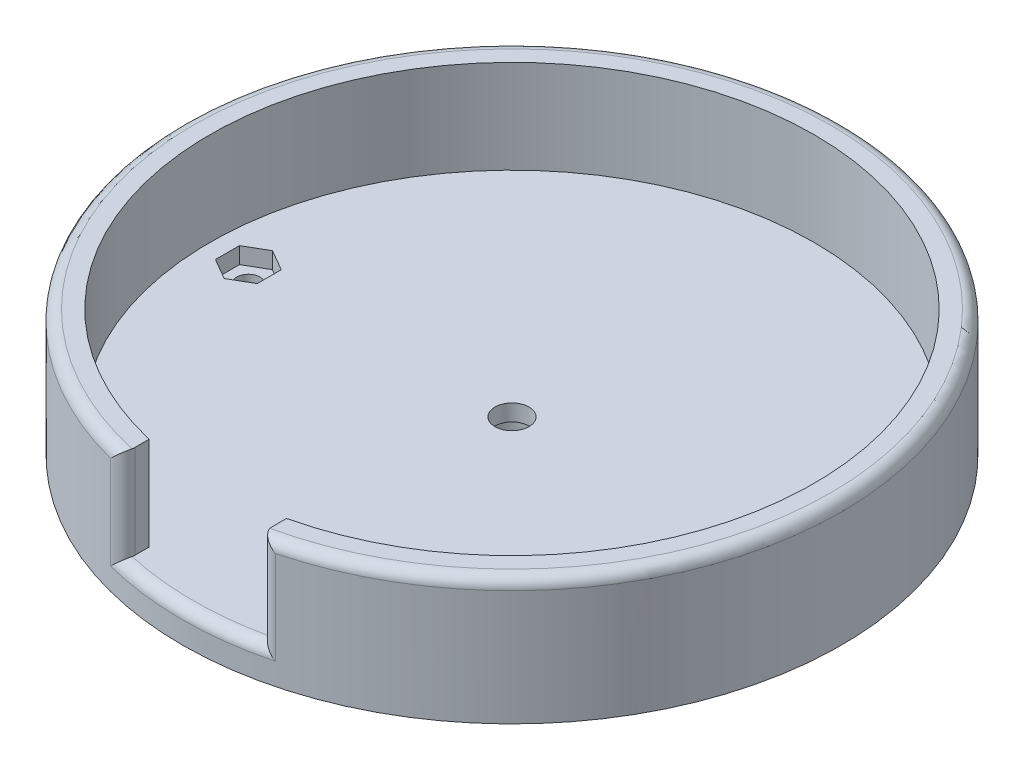
ISO-10303-21;
HEADER;
FILE_DESCRIPTION(('STEP AP214'),'2;1');
FILE_NAME('part.step','',(''),(''),'','','');
FILE_SCHEMA(('AUTOMOTIVE_DESIGN { 1 0 10303 214 1 1 1 1 }'));
ENDSEC;
DATA;
#1=APPLICATION_CONTEXT('core data for automotive mechanical design processes');
#2=APPLICATION_PROTOCOL_DEFINITION('international standard','automotive_design',2000,#1);
#3=PRODUCT_CONTEXT('',#1,'mechanical');
#4=PRODUCT('Part','Part','',(#3));
#5=PRODUCT_RELATED_PRODUCT_CATEGORY('part','',(#4));
#6=PRODUCT_DEFINITION_FORMATION('','',#4);
#7=PRODUCT_DEFINITION_CONTEXT('part definition',#1,'design');
#8=PRODUCT_DEFINITION('design','',#6,#7);
#9=PRODUCT_DEFINITION_SHAPE('','',#8);
#10=(LENGTH_UNIT() NAMED_UNIT(*) SI_UNIT(.MILLI.,.METRE.));
#11=(NAMED_UNIT(*) PLANE_ANGLE_UNIT() SI_UNIT($,.RADIAN.));
#12=(NAMED_UNIT(*) SI_UNIT($,.STERADIAN.) SOLID_ANGLE_UNIT());
#13=UNCERTAINTY_MEASURE_WITH_UNIT(LENGTH_MEASURE(1.E-05),#10,'distance_accuracy_value','');
#14=(GEOMETRIC_REPRESENTATION_CONTEXT(3) GLOBAL_UNCERTAINTY_ASSIGNED_CONTEXT((#13)) GLOBAL_UNIT_ASSIGNED_CONTEXT((#10,
#11,#12)) REPRESENTATION_CONTEXT('',''));
#15=CARTESIAN_POINT('',(0.,0.,0.));
#16=DIRECTION('',(0.,0.,1.));
#17=DIRECTION('',(1.,0.,0.));
#18=AXIS2_PLACEMENT_3D('',#15,#16,#17);
#19=CARTESIAN_POINT('',(0.,6.,0.));
#20=DIRECTION('',(0.,-1.,0.));
#21=DIRECTION('',(0.,0.,-1.));
#22=AXIS2_PLACEMENT_3D('',#19,#20,#21);
#23=CYLINDRICAL_SURFACE('',#22,60.);
#24=DIRECTION('',(0.,-1.,0.));
#25=VECTOR('',#24,1.);
#26=CARTESIAN_POINT('',(15.,6.,58.0947501931113));
#27=LINE('',#26,#25);
#28=CARTESIAN_POINT('',(15.,21.,58.0947501931113));
#29=VERTEX_POINT('',#28);
#30=CARTESIAN_POINT('',(15.,4.,58.0947501931113));
#31=VERTEX_POINT('',#30);
#32=EDGE_CURVE('E344',#29,#31,#27,.T.);
#33=ORIENTED_EDGE('',*,*,#32,.T.);
#34=CARTESIAN_POINT('',(0.,4.,0.));
#35=DIRECTION('',(0.,1.,0.));
#36=DIRECTION('',(0.,0.,1.));
#37=AXIS2_PLACEMENT_3D('',#34,#35,#36);
#38=CIRCLE('',#37,60.);
#39=CARTESIAN_POINT('',(-15.,4.,58.0947501931113));
#40=VERTEX_POINT('',#39);
#41=EDGE_CURVE('E347',#31,#40,#38,.F.);
#42=ORIENTED_EDGE('',*,*,#41,.T.);
#43=DIRECTION('',(0.,-1.,0.));
#44=VECTOR('',#43,1.);
#45=CARTESIAN_POINT('',(-15.,6.,58.0947501931113));
#46=LINE('',#45,#44);
#47=CARTESIAN_POINT('',(-15.,21.,58.0947501931113));
#48=VERTEX_POINT('',#47);
#49=EDGE_CURVE('E342',#40,#48,#46,.F.);
#50=ORIENTED_EDGE('',*,*,#49,.T.);
#51=CARTESIAN_POINT('',(0.,21.,0.));
#52=DIRECTION('',(0.,1.,0.));
#53=DIRECTION('',(0.,0.,1.));
#54=AXIS2_PLACEMENT_3D('',#51,#52,#53);
#55=CIRCLE('',#54,60.);
#56=EDGE_CURVE('E340',#48,#29,#55,.F.);
#57=ORIENTED_EDGE('',*,*,#56,.T.);
#58=EDGE_LOOP('',(#33,#42,#50,#57));
#59=FACE_BOUND('',#58,.T.);
#60=CARTESIAN_POINT('',(0.,0.,0.));
#61=DIRECTION('',(0.,1.,0.));
#62=DIRECTION('',(0.,0.,1.));
#63=AXIS2_PLACEMENT_3D('',#60,#61,#62);
#64=CIRCLE('',#63,60.);
#65=CARTESIAN_POINT('',(0.,0.,60.));
#66=VERTEX_POINT('',#65);
#67=EDGE_CURVE('E322',#66,#66,#64,.T.);
#68=ORIENTED_EDGE('',*,*,#67,.T.);
#69=EDGE_LOOP('',(#68));
#70=FACE_BOUND('',#69,.T.);
#71=ADVANCED_FACE('F34',(#59,#70),#23,.T.);
#72=CARTESIAN_POINT('',(0.,23.,0.));
#73=DIRECTION('',(0.,1.,0.));
#74=DIRECTION('',(0.,0.,1.));
#75=AXIS2_PLACEMENT_3D('',#72,#73,#74);
#76=PLANE('',#75);
#77=DIRECTION('',(0.,0.,-1.));
#78=VECTOR('',#77,1.);
#79=CARTESIAN_POINT('',(12.5,23.,67.5));
#80=LINE('',#79,#78);
#81=CARTESIAN_POINT('',(12.5,23.,56.1582585200075));
#82=VERTEX_POINT('',#81);
#83=CARTESIAN_POINT('',(12.5,23.,53.5607132140714));
#84=VERTEX_POINT('',#83);
#85=EDGE_CURVE('E201',#82,#84,#80,.T.);
#86=ORIENTED_EDGE('',*,*,#85,.F.);
#87=CARTESIAN_POINT('',(14.5,23.,56.1582585200075));
#88=DIRECTION('',(0.,1.,0.));
#89=DIRECTION('',(0.,0.,1.));
#90=AXIS2_PLACEMENT_3D('',#87,#88,#89);
#91=CIRCLE('',#90,2.);
#92=CARTESIAN_POINT('',(12.5551754843885,23.,56.6247964107264));
#93=VERTEX_POINT('',#92);
#94=EDGE_CURVE('E338',#82,#93,#91,.T.);
#95=ORIENTED_EDGE('',*,*,#94,.T.);
#96=CARTESIAN_POINT('',(0.,23.,0.));
#97=DIRECTION('',(0.,1.,0.));
#98=DIRECTION('',(0.,0.,1.));
#99=AXIS2_PLACEMENT_3D('',#96,#97,#98);
#100=CIRCLE('',#99,58.);
#101=CARTESIAN_POINT('',(-12.5551754843885,23.,56.6247964107264));
#102=VERTEX_POINT('',#101);
#103=EDGE_CURVE('E334',#93,#102,#100,.T.);
#104=ORIENTED_EDGE('',*,*,#103,.T.);
#105=CARTESIAN_POINT('',(-14.5,23.,56.1582585200075));
#106=DIRECTION('',(0.,1.,0.));
#107=DIRECTION('',(0.,0.,1.));
#108=AXIS2_PLACEMENT_3D('',#105,#106,#107);
#109=CIRCLE('',#108,2.);
#110=CARTESIAN_POINT('',(-12.5,23.,56.1582585200075));
#111=VERTEX_POINT('',#110);
#112=EDGE_CURVE('E336',#102,#111,#109,.T.);
#113=ORIENTED_EDGE('',*,*,#112,.T.);
#114=DIRECTION('',(0.,0.,1.));
#115=VECTOR('',#114,1.);
#116=CARTESIAN_POINT('',(-12.5,23.,67.5));
#117=LINE('',#116,#115);
#118=CARTESIAN_POINT('',(-12.5,23.,53.5607132140714));
#119=VERTEX_POINT('',#118);
#120=EDGE_CURVE('E205',#119,#111,#117,.T.);
#121=ORIENTED_EDGE('',*,*,#120,.F.);
#122=CARTESIAN_POINT('',(0.,23.,0.));
#123=DIRECTION('',(0.,1.,0.));
#124=DIRECTION('',(0.,0.,1.));
#125=AXIS2_PLACEMENT_3D('',#122,#123,#124);
#126=CIRCLE('',#125,55.);
#127=EDGE_CURVE('E193',#84,#119,#126,.T.);
#128=ORIENTED_EDGE('',*,*,#127,.F.);
#129=EDGE_LOOP('',(#86,#95,#104,#113,#121,#128));
#130=FACE_BOUND('',#129,.T.);
#131=ADVANCED_FACE('F386',(#130),#76,.T.);
#132=CARTESIAN_POINT('',(0.,23.,0.));
#133=DIRECTION('',(0.,-1.,0.));
#134=DIRECTION('',(0.,0.,-1.));
#135=AXIS2_PLACEMENT_3D('',#132,#133,#134);
#136=CYLINDRICAL_SURFACE('',#135,55.);
#137=ORIENTED_EDGE('',*,*,#127,.T.);
#138=DIRECTION('',(0.,-1.,0.));
#139=VECTOR('',#138,1.);
#140=CARTESIAN_POINT('',(-12.5,23.,53.5607132140714));
#141=LINE('',#140,#139);
#142=CARTESIAN_POINT('',(-12.5,6.,53.5607132140714));
#143=VERTEX_POINT('',#142);
#144=EDGE_CURVE('E178',#119,#143,#141,.T.);
#145=ORIENTED_EDGE('',*,*,#144,.T.);
#146=CARTESIAN_POINT('',(0.,6.,0.));
#147=DIRECTION('',(0.,1.,0.));
#148=DIRECTION('',(0.,0.,1.));
#149=AXIS2_PLACEMENT_3D('',#146,#147,#148);
#150=CIRCLE('',#149,55.);
#151=CARTESIAN_POINT('',(12.5,6.,53.5607132140714));
#152=VERTEX_POINT('',#151);
#153=EDGE_CURVE('E191',#152,#143,#150,.T.);
#154=ORIENTED_EDGE('',*,*,#153,.F.);
#155=DIRECTION('',(0.,-1.,0.));
#156=VECTOR('',#155,1.);
#157=CARTESIAN_POINT('',(12.5,23.,53.5607132140714));
#158=LINE('',#157,#156);
#159=EDGE_CURVE('E195',#152,#84,#158,.F.);
#160=ORIENTED_EDGE('',*,*,#159,.T.);
#161=EDGE_LOOP('',(#137,#145,#154,#160));
#162=FACE_BOUND('',#161,.T.);
#163=ADVANCED_FACE('F189',(#162),#136,.F.);
#164=CARTESIAN_POINT('',(0.,6.,0.));
#165=DIRECTION('',(0.,1.,0.));
#166=DIRECTION('',(0.,0.,1.));
#167=AXIS2_PLACEMENT_3D('',#164,#165,#166);
#168=PLANE('',#167);
#169=CARTESIAN_POINT('',(-14.5,6.,56.1582585200075));
#170=DIRECTION('',(0.,1.,0.));
#171=DIRECTION('',(0.,0.,1.));
#172=AXIS2_PLACEMENT_3D('',#169,#170,#171);
#173=CIRCLE('',#172,2.);
#174=CARTESIAN_POINT('',(-12.5,6.,56.1582585200075));
#175=VERTEX_POINT('',#174);
#176=CARTESIAN_POINT('',(-12.5551754843885,6.,56.6247964107264));
#177=VERTEX_POINT('',#176);
#178=EDGE_CURVE('E11',#175,#177,#173,.F.);
#179=ORIENTED_EDGE('',*,*,#178,.T.);
#180=CARTESIAN_POINT('',(0.,6.,0.));
#181=DIRECTION('',(0.,1.,0.));
#182=DIRECTION('',(0.,0.,1.));
#183=AXIS2_PLACEMENT_3D('',#180,#181,#182);
#184=CIRCLE('',#183,58.);
#185=CARTESIAN_POINT('',(12.5551754843885,6.,56.6247964107264));
#186=VERTEX_POINT('',#185);
#187=EDGE_CURVE('E56',#177,#186,#184,.T.);
#188=ORIENTED_EDGE('',*,*,#187,.T.);
#189=CARTESIAN_POINT('',(14.5,6.,56.1582585200075));
#190=DIRECTION('',(0.,1.,0.));
#191=DIRECTION('',(0.,0.,1.));
#192=AXIS2_PLACEMENT_3D('',#189,#190,#191);
#193=CIRCLE('',#192,2.);
#194=CARTESIAN_POINT('',(12.5,6.,56.1582585200075));
#195=VERTEX_POINT('',#194);
#196=EDGE_CURVE('E48',#186,#195,#193,.F.);
#197=ORIENTED_EDGE('',*,*,#196,.T.);
#198=DIRECTION('',(0.,0.,-1.));
#199=VECTOR('',#198,1.);
#200=CARTESIAN_POINT('',(12.5,6.,67.5));
#201=LINE('',#200,#199);
#202=EDGE_CURVE('E184',#195,#152,#201,.T.);
#203=ORIENTED_EDGE('',*,*,#202,.T.);
#204=ORIENTED_EDGE('',*,*,#153,.T.);
#205=DIRECTION('',(0.,0.,1.));
#206=VECTOR('',#205,1.);
#207=CARTESIAN_POINT('',(-12.5,6.,67.5));
#208=LINE('',#207,#206);
#209=EDGE_CURVE('E174',#143,#175,#208,.T.);
#210=ORIENTED_EDGE('',*,*,#209,.T.);
#211=EDGE_LOOP('',(#179,#188,#197,#203,#204,#210));
#212=FACE_BOUND('',#211,.T.);
#213=CARTESIAN_POINT('',(0.,6.,0.));
#214=DIRECTION('',(0.,1.,0.));
#215=DIRECTION('',(0.,0.,1.));
#216=AXIS2_PLACEMENT_3D('',#213,#214,#215);
#217=CIRCLE('',#216,3.1);
#218=CARTESIAN_POINT('',(0.,6.,3.1));
#219=VERTEX_POINT('',#218);
#220=EDGE_CURVE('E315',#219,#219,#217,.T.);
#221=ORIENTED_EDGE('',*,*,#220,.F.);
#222=EDGE_LOOP('',(#221));
#223=FACE_BOUND('',#222,.T.);
#224=DIRECTION('',(-0.866025403784439,0.,0.5));
#225=VECTOR('',#224,1.);
#226=CARTESIAN_POINT('',(44.2,6.,-2.19393102292057));
#227=LINE('',#226,#225);
#228=CARTESIAN_POINT('',(48.,6.,-4.38786204584115));
#229=VERTEX_POINT('',#228);
#230=CARTESIAN_POINT('',(44.2,6.,-2.19393102292057));
#231=VERTEX_POINT('',#230);
#232=EDGE_CURVE('E285',#229,#231,#227,.T.);
#233=ORIENTED_EDGE('',*,*,#232,.F.);
#234=DIRECTION('',(-0.866025403784438,0.,-0.5));
#235=VECTOR('',#234,1.);
#236=CARTESIAN_POINT('',(48.,6.,-4.38786204584115));
#237=LINE('',#236,#235);
#238=CARTESIAN_POINT('',(51.8,6.,-2.19393102292058));
#239=VERTEX_POINT('',#238);
#240=EDGE_CURVE('E269',#239,#229,#237,.T.);
#241=ORIENTED_EDGE('',*,*,#240,.F.);
#242=DIRECTION('',(0.,0.,-1.));
#243=VECTOR('',#242,1.);
#244=CARTESIAN_POINT('',(51.8,6.,-2.19393102292058));
#245=LINE('',#244,#243);
#246=CARTESIAN_POINT('',(51.8,6.,2.19393102292057));
#247=VERTEX_POINT('',#246);
#248=EDGE_CURVE('E296',#247,#239,#245,.T.);
#249=ORIENTED_EDGE('',*,*,#248,.F.);
#250=DIRECTION('',(0.866025403784439,0.,-0.5));
#251=VECTOR('',#250,1.);
#252=CARTESIAN_POINT('',(51.8,6.,2.19393102292057));
#253=LINE('',#252,#251);
#254=CARTESIAN_POINT('',(48.,6.,4.38786204584116));
#255=VERTEX_POINT('',#254);
#256=EDGE_CURVE('E293',#255,#247,#253,.T.);
#257=ORIENTED_EDGE('',*,*,#256,.F.);
#258=DIRECTION('',(0.866025403784439,0.,0.5));
#259=VECTOR('',#258,1.);
#260=CARTESIAN_POINT('',(48.,6.,4.38786204584116));
#261=LINE('',#260,#259);
#262=CARTESIAN_POINT('',(44.2,6.,2.19393102292058));
#263=VERTEX_POINT('',#262);
#264=EDGE_CURVE('E290',#263,#255,#261,.T.);
#265=ORIENTED_EDGE('',*,*,#264,.F.);
#266=DIRECTION('',(0.,0.,1.));
#267=VECTOR('',#266,1.);
#268=CARTESIAN_POINT('',(44.2,6.,2.19393102292058));
#269=LINE('',#268,#267);
#270=EDGE_CURVE('E287',#231,#263,#269,.T.);
#271=ORIENTED_EDGE('',*,*,#270,.F.);
#272=EDGE_LOOP('',(#233,#241,#249,#257,#265,#271));
#273=FACE_BOUND('',#272,.T.);
#274=DIRECTION('',(-0.866025403784438,0.,0.5));
#275=VECTOR('',#274,1.);
#276=CARTESIAN_POINT('',(-48.,6.,-4.38786204584115));
#277=LINE('',#276,#275);
#278=CARTESIAN_POINT('',(-48.,6.,-4.38786204584115));
#279=VERTEX_POINT('',#278);
#280=CARTESIAN_POINT('',(-51.8,6.,-2.19393102292058));
#281=VERTEX_POINT('',#280);
#282=EDGE_CURVE('E235',#279,#281,#277,.T.);
#283=ORIENTED_EDGE('',*,*,#282,.F.);
#284=DIRECTION('',(-0.866025403784439,0.,-0.5));
#285=VECTOR('',#284,1.);
#286=CARTESIAN_POINT('',(-44.2,6.,-2.19393102292057));
#287=LINE('',#286,#285);
#288=CARTESIAN_POINT('',(-44.2,6.,-2.19393102292057));
#289=VERTEX_POINT('',#288);
#290=EDGE_CURVE('E219',#289,#279,#287,.T.);
#291=ORIENTED_EDGE('',*,*,#290,.F.);
#292=DIRECTION('',(0.,0.,-1.));
#293=VECTOR('',#292,1.);
#294=CARTESIAN_POINT('',(-44.2,6.,2.19393102292058));
#295=LINE('',#294,#293);
#296=CARTESIAN_POINT('',(-44.2,6.,2.19393102292058));
#297=VERTEX_POINT('',#296);
#298=EDGE_CURVE('E247',#297,#289,#295,.T.);
#299=ORIENTED_EDGE('',*,*,#298,.F.);
#300=DIRECTION('',(0.866025403784439,0.,-0.5));
#301=VECTOR('',#300,1.);
#302=CARTESIAN_POINT('',(-48.,6.,4.38786204584116));
#303=LINE('',#302,#301);
#304=CARTESIAN_POINT('',(-48.,6.,4.38786204584116));
#305=VERTEX_POINT('',#304);
#306=EDGE_CURVE('E244',#305,#297,#303,.T.);
#307=ORIENTED_EDGE('',*,*,#306,.F.);
#308=DIRECTION('',(0.866025403784439,0.,0.5));
#309=VECTOR('',#308,1.);
#310=CARTESIAN_POINT('',(-51.8,6.,2.19393102292057));
#311=LINE('',#310,#309);
#312=CARTESIAN_POINT('',(-51.8,6.,2.19393102292057));
#313=VERTEX_POINT('',#312);
#314=EDGE_CURVE('E241',#313,#305,#311,.T.);
#315=ORIENTED_EDGE('',*,*,#314,.F.);
#316=DIRECTION('',(0.,0.,1.));
#317=VECTOR('',#316,1.);
#318=CARTESIAN_POINT('',(-51.8,6.,-2.19393102292058));
#319=LINE('',#318,#317);
#320=EDGE_CURVE('E237',#281,#313,#319,.T.);
#321=ORIENTED_EDGE('',*,*,#320,.F.);
#322=EDGE_LOOP('',(#283,#291,#299,#307,#315,#321));
#323=FACE_BOUND('',#322,.T.);
#324=ADVANCED_FACE('F197',(#212,#223,#273,#323),#168,.T.);
#325=CARTESIAN_POINT('',(0.,6.,0.));
#326=DIRECTION('',(0.,-1.,0.));
#327=DIRECTION('',(0.,0.,-1.));
#328=AXIS2_PLACEMENT_3D('',#325,#326,#327);
#329=CYLINDRICAL_SURFACE('',#328,3.1);
#330=ORIENTED_EDGE('',*,*,#220,.T.);
#331=EDGE_LOOP('',(#330));
#332=FACE_BOUND('',#331,.T.);
#333=CARTESIAN_POINT('',(0.,3.,0.));
#334=DIRECTION('',(0.,-1.,0.));
#335=DIRECTION('',(0.,0.,-1.));
#336=AXIS2_PLACEMENT_3D('',#333,#334,#335);
#337=CIRCLE('',#336,3.1);
#338=CARTESIAN_POINT('',(0.,3.,-3.1));
#339=VERTEX_POINT('',#338);
#340=EDGE_CURVE('E212',#339,#339,#337,.T.);
#341=ORIENTED_EDGE('',*,*,#340,.T.);
#342=EDGE_LOOP('',(#341));
#343=FACE_BOUND('',#342,.T.);
#344=ADVANCED_FACE('F403',(#332,#343),#329,.F.);
#345=CARTESIAN_POINT('',(-48.,6.,0.));
#346=DIRECTION('',(0.,-1.,0.));
#347=DIRECTION('',(0.,0.,-1.));
#348=AXIS2_PLACEMENT_3D('',#345,#346,#347);
#349=CYLINDRICAL_SURFACE('',#348,2.1);
#350=CARTESIAN_POINT('',(-48.,0.,0.));
#351=DIRECTION('',(0.,1.,0.));
#352=DIRECTION('',(0.,0.,1.));
#353=AXIS2_PLACEMENT_3D('',#350,#351,#352);
#354=CIRCLE('',#353,2.1);
#355=CARTESIAN_POINT('',(-48.,0.,2.1));
#356=VERTEX_POINT('',#355);
#357=EDGE_CURVE('E319',#356,#356,#354,.T.);
#358=ORIENTED_EDGE('',*,*,#357,.F.);
#359=EDGE_LOOP('',(#358));
#360=FACE_BOUND('',#359,.T.);
#361=CARTESIAN_POINT('',(-48.,3.,0.));
#362=DIRECTION('',(0.,1.,0.));
#363=DIRECTION('',(0.,0.,1.));
#364=AXIS2_PLACEMENT_3D('',#361,#362,#363);
#365=CIRCLE('',#364,2.1);
#366=CARTESIAN_POINT('',(-48.,3.,2.1));
#367=VERTEX_POINT('',#366);
#368=EDGE_CURVE('E316',#367,#367,#365,.T.);
#369=ORIENTED_EDGE('',*,*,#368,.T.);
#370=EDGE_LOOP('',(#369));
#371=FACE_BOUND('',#370,.T.);
#372=ADVANCED_FACE('F399',(#360,#371),#349,.F.);
#373=CARTESIAN_POINT('',(0.,0.,0.));
#374=DIRECTION('',(0.,1.,0.));
#375=DIRECTION('',(0.,0.,1.));
#376=AXIS2_PLACEMENT_3D('',#373,#374,#375);
#377=PLANE('',#376);
#378=CARTESIAN_POINT('',(0.,0.,0.));
#379=DIRECTION('',(0.,-1.,0.));
#380=DIRECTION('',(0.,0.,-1.));
#381=AXIS2_PLACEMENT_3D('',#378,#379,#380);
#382=CIRCLE('',#381,4.8);
#383=CARTESIAN_POINT('',(0.,0.,-4.8));
#384=VERTEX_POINT('',#383);
#385=EDGE_CURVE('E203',#384,#384,#382,.T.);
#386=ORIENTED_EDGE('',*,*,#385,.F.);
#387=EDGE_LOOP('',(#386));
#388=FACE_BOUND('',#387,.T.);
#389=ORIENTED_EDGE('',*,*,#67,.F.);
#390=EDGE_LOOP('',(#389));
#391=FACE_BOUND('',#390,.T.);
#392=ORIENTED_EDGE('',*,*,#357,.T.);
#393=EDGE_LOOP('',(#392));
#394=FACE_BOUND('',#393,.T.);
#395=CARTESIAN_POINT('',(48.,0.,0.));
#396=DIRECTION('',(0.,1.,0.));
#397=DIRECTION('',(0.,0.,-1.));
#398=AXIS2_PLACEMENT_3D('',#395,#396,#397);
#399=CIRCLE('',#398,2.1);
#400=CARTESIAN_POINT('',(48.,0.,-2.1));
#401=VERTEX_POINT('',#400);
#402=EDGE_CURVE('E312',#401,#401,#399,.T.);
#403=ORIENTED_EDGE('',*,*,#402,.T.);
#404=EDGE_LOOP('',(#403));
#405=FACE_BOUND('',#404,.T.);
#406=ADVANCED_FACE('F395',(#388,#391,#394,#405),#377,.F.);
#407=CARTESIAN_POINT('',(48.,6.,0.));
#408=DIRECTION('',(0.,-1.,0.));
#409=DIRECTION('',(0.,0.,-1.));
#410=AXIS2_PLACEMENT_3D('',#407,#408,#409);
#411=CYLINDRICAL_SURFACE('',#410,2.1);
#412=CARTESIAN_POINT('',(48.,3.,0.));
#413=DIRECTION('',(0.,-1.,0.));
#414=DIRECTION('',(0.,0.,-1.));
#415=AXIS2_PLACEMENT_3D('',#412,#413,#414);
#416=CIRCLE('',#415,2.1);
#417=CARTESIAN_POINT('',(48.,3.,-2.1));
#418=VERTEX_POINT('',#417);
#419=EDGE_CURVE('E254',#418,#418,#416,.T.);
#420=ORIENTED_EDGE('',*,*,#419,.F.);
#421=EDGE_LOOP('',(#420));
#422=FACE_BOUND('',#421,.T.);
#423=ORIENTED_EDGE('',*,*,#402,.F.);
#424=EDGE_LOOP('',(#423));
#425=FACE_BOUND('',#424,.T.);
#426=ADVANCED_FACE('F398',(#422,#425),#411,.F.);
#427=CARTESIAN_POINT('',(44.2,3.,-2.19393102292057));
#428=DIRECTION('',(-0.5,0.,-0.866025403784439));
#429=DIRECTION('',(-0.866025403784439,0.,0.5));
#430=AXIS2_PLACEMENT_3D('',#427,#428,#429);
#431=PLANE('',#430);
#432=ORIENTED_EDGE('',*,*,#232,.T.);
#433=DIRECTION('',(0.,1.,0.));
#434=VECTOR('',#433,1.);
#435=CARTESIAN_POINT('',(44.2,3.,-2.19393102292057));
#436=LINE('',#435,#434);
#437=CARTESIAN_POINT('',(44.2,3.,-2.19393102292057));
#438=VERTEX_POINT('',#437);
#439=EDGE_CURVE('E284',#438,#231,#436,.T.);
#440=ORIENTED_EDGE('',*,*,#439,.F.);
#441=DIRECTION('',(-0.866025403784439,0.,0.5));
#442=VECTOR('',#441,1.);
#443=CARTESIAN_POINT('',(44.2,3.,-2.19393102292057));
#444=LINE('',#443,#442);
#445=CARTESIAN_POINT('',(48.,3.,-4.38786204584115));
#446=VERTEX_POINT('',#445);
#447=EDGE_CURVE('E265',#446,#438,#444,.T.);
#448=ORIENTED_EDGE('',*,*,#447,.F.);
#449=DIRECTION('',(0.,1.,0.));
#450=VECTOR('',#449,1.);
#451=CARTESIAN_POINT('',(48.,3.,-4.38786204584115));
#452=LINE('',#451,#450);
#453=EDGE_CURVE('E238',#446,#229,#452,.T.);
#454=ORIENTED_EDGE('',*,*,#453,.T.);
#455=EDGE_LOOP('',(#432,#440,#448,#454));
#456=FACE_BOUND('',#455,.T.);
#457=ADVANCED_FACE('F412',(#456),#431,.F.);
#458=CARTESIAN_POINT('',(48.,3.,-4.38786204584115));
#459=DIRECTION('',(0.5,0.,-0.866025403784439));
#460=DIRECTION('',(-0.866025403784439,0.,-0.5));
#461=AXIS2_PLACEMENT_3D('',#458,#459,#460);
#462=PLANE('',#461);
#463=ORIENTED_EDGE('',*,*,#240,.T.);
#464=ORIENTED_EDGE('',*,*,#453,.F.);
#465=DIRECTION('',(-0.866025403784438,0.,-0.5));
#466=VECTOR('',#465,1.);
#467=CARTESIAN_POINT('',(48.,3.,-4.38786204584115));
#468=LINE('',#467,#466);
#469=CARTESIAN_POINT('',(51.8,3.,-2.19393102292058));
#470=VERTEX_POINT('',#469);
#471=EDGE_CURVE('E281',#470,#446,#468,.T.);
#472=ORIENTED_EDGE('',*,*,#471,.F.);
#473=DIRECTION('',(0.,1.,0.));
#474=VECTOR('',#473,1.);
#475=CARTESIAN_POINT('',(51.8,3.,-2.19393102292058));
#476=LINE('',#475,#474);
#477=EDGE_CURVE('E302',#470,#239,#476,.T.);
#478=ORIENTED_EDGE('',*,*,#477,.T.);
#479=EDGE_LOOP('',(#463,#464,#472,#478));
#480=FACE_BOUND('',#479,.T.);
#481=ADVANCED_FACE('F416',(#480),#462,.F.);
#482=CARTESIAN_POINT('',(51.8,3.,-2.19393102292058));
#483=DIRECTION('',(1.,0.,0.));
#484=DIRECTION('',(0.,0.,-1.));
#485=AXIS2_PLACEMENT_3D('',#482,#483,#484);
#486=PLANE('',#485);
#487=ORIENTED_EDGE('',*,*,#248,.T.);
#488=ORIENTED_EDGE('',*,*,#477,.F.);
#489=DIRECTION('',(0.,0.,-1.));
#490=VECTOR('',#489,1.);
#491=CARTESIAN_POINT('',(51.8,3.,-2.19393102292058));
#492=LINE('',#491,#490);
#493=CARTESIAN_POINT('',(51.8,3.,2.19393102292057));
#494=VERTEX_POINT('',#493);
#495=EDGE_CURVE('E278',#494,#470,#492,.T.);
#496=ORIENTED_EDGE('',*,*,#495,.F.);
#497=DIRECTION('',(0.,1.,0.));
#498=VECTOR('',#497,1.);
#499=CARTESIAN_POINT('',(51.8,3.,2.19393102292057));
#500=LINE('',#499,#498);
#501=EDGE_CURVE('E304',#494,#247,#500,.T.);
#502=ORIENTED_EDGE('',*,*,#501,.T.);
#503=EDGE_LOOP('',(#487,#488,#496,#502));
#504=FACE_BOUND('',#503,.T.);
#505=ADVANCED_FACE('F430',(#504),#486,.F.);
#506=CARTESIAN_POINT('',(51.8,3.,2.19393102292057));
#507=DIRECTION('',(0.5,0.,0.866025403784438));
#508=DIRECTION('',(0.866025403784439,0.,-0.5));
#509=AXIS2_PLACEMENT_3D('',#506,#507,#508);
#510=PLANE('',#509);
#511=ORIENTED_EDGE('',*,*,#256,.T.);
#512=ORIENTED_EDGE('',*,*,#501,.F.);
#513=DIRECTION('',(0.866025403784439,0.,-0.5));
#514=VECTOR('',#513,1.);
#515=CARTESIAN_POINT('',(51.8,3.,2.19393102292057));
#516=LINE('',#515,#514);
#517=CARTESIAN_POINT('',(48.,3.,4.38786204584116));
#518=VERTEX_POINT('',#517);
#519=EDGE_CURVE('E275',#518,#494,#516,.T.);
#520=ORIENTED_EDGE('',*,*,#519,.F.);
#521=DIRECTION('',(0.,1.,0.));
#522=VECTOR('',#521,1.);
#523=CARTESIAN_POINT('',(48.,3.,4.38786204584116));
#524=LINE('',#523,#522);
#525=EDGE_CURVE('E306',#518,#255,#524,.T.);
#526=ORIENTED_EDGE('',*,*,#525,.T.);
#527=EDGE_LOOP('',(#511,#512,#520,#526));
#528=FACE_BOUND('',#527,.T.);
#529=ADVANCED_FACE('F426',(#528),#510,.F.);
#530=CARTESIAN_POINT('',(48.,3.,4.38786204584116));
#531=DIRECTION('',(-0.5,0.,0.866025403784439));
#532=DIRECTION('',(0.866025403784439,0.,0.5));
#533=AXIS2_PLACEMENT_3D('',#530,#531,#532);
#534=PLANE('',#533);
#535=ORIENTED_EDGE('',*,*,#264,.T.);
#536=ORIENTED_EDGE('',*,*,#525,.F.);
#537=DIRECTION('',(0.866025403784439,0.,0.5));
#538=VECTOR('',#537,1.);
#539=CARTESIAN_POINT('',(48.,3.,4.38786204584116));
#540=LINE('',#539,#538);
#541=CARTESIAN_POINT('',(44.2,3.,2.19393102292058));
#542=VERTEX_POINT('',#541);
#543=EDGE_CURVE('E272',#542,#518,#540,.T.);
#544=ORIENTED_EDGE('',*,*,#543,.F.);
#545=DIRECTION('',(0.,1.,0.));
#546=VECTOR('',#545,1.);
#547=CARTESIAN_POINT('',(44.2,3.,2.19393102292058));
#548=LINE('',#547,#546);
#549=EDGE_CURVE('E308',#542,#263,#548,.T.);
#550=ORIENTED_EDGE('',*,*,#549,.T.);
#551=EDGE_LOOP('',(#535,#536,#544,#550));
#552=FACE_BOUND('',#551,.T.);
#553=ADVANCED_FACE('F422',(#552),#534,.F.);
#554=CARTESIAN_POINT('',(44.2,3.,2.19393102292058));
#555=DIRECTION('',(-1.,0.,0.));
#556=DIRECTION('',(0.,0.,1.));
#557=AXIS2_PLACEMENT_3D('',#554,#555,#556);
#558=PLANE('',#557);
#559=ORIENTED_EDGE('',*,*,#270,.T.);
#560=ORIENTED_EDGE('',*,*,#549,.F.);
#561=DIRECTION('',(0.,0.,1.));
#562=VECTOR('',#561,1.);
#563=CARTESIAN_POINT('',(44.2,3.,2.19393102292058));
#564=LINE('',#563,#562);
#565=EDGE_CURVE('E268',#438,#542,#564,.T.);
#566=ORIENTED_EDGE('',*,*,#565,.F.);
#567=ORIENTED_EDGE('',*,*,#439,.T.);
#568=EDGE_LOOP('',(#559,#560,#566,#567));
#569=FACE_BOUND('',#568,.T.);
#570=ADVANCED_FACE('F418',(#569),#558,.F.);
#571=CARTESIAN_POINT('',(0.,3.,0.));
#572=DIRECTION('',(0.,-1.,0.));
#573=DIRECTION('',(0.,0.,-1.));
#574=AXIS2_PLACEMENT_3D('',#571,#572,#573);
#575=PLANE('',#574);
#576=ORIENTED_EDGE('',*,*,#419,.T.);
#577=EDGE_LOOP('',(#576));
#578=FACE_BOUND('',#577,.T.);
#579=ORIENTED_EDGE('',*,*,#447,.T.);
#580=ORIENTED_EDGE('',*,*,#565,.T.);
#581=ORIENTED_EDGE('',*,*,#543,.T.);
#582=ORIENTED_EDGE('',*,*,#519,.T.);
#583=ORIENTED_EDGE('',*,*,#495,.T.);
#584=ORIENTED_EDGE('',*,*,#471,.T.);
#585=EDGE_LOOP('',(#579,#580,#581,#582,#583,#584));
#586=FACE_BOUND('',#585,.T.);
#587=ADVANCED_FACE('F421',(#578,#586),#575,.F.);
#588=CARTESIAN_POINT('',(-48.,3.,-4.38786204584115));
#589=DIRECTION('',(-0.5,0.,-0.866025403784439));
#590=DIRECTION('',(-0.866025403784439,0.,0.5));
#591=AXIS2_PLACEMENT_3D('',#588,#589,#590);
#592=PLANE('',#591);
#593=ORIENTED_EDGE('',*,*,#282,.T.);
#594=DIRECTION('',(0.,1.,0.));
#595=VECTOR('',#594,1.);
#596=CARTESIAN_POINT('',(-51.8,3.,-2.19393102292058));
#597=LINE('',#596,#595);
#598=CARTESIAN_POINT('',(-51.8,3.,-2.19393102292058));
#599=VERTEX_POINT('',#598);
#600=EDGE_CURVE('E234',#599,#281,#597,.T.);
#601=ORIENTED_EDGE('',*,*,#600,.F.);
#602=DIRECTION('',(-0.866025403784438,0.,0.5));
#603=VECTOR('',#602,1.);
#604=CARTESIAN_POINT('',(-48.,3.,-4.38786204584115));
#605=LINE('',#604,#603);
#606=CARTESIAN_POINT('',(-48.,3.,-4.38786204584115));
#607=VERTEX_POINT('',#606);
#608=EDGE_CURVE('E215',#607,#599,#605,.T.);
#609=ORIENTED_EDGE('',*,*,#608,.F.);
#610=DIRECTION('',(0.,1.,0.));
#611=VECTOR('',#610,1.);
#612=CARTESIAN_POINT('',(-48.,3.,-4.38786204584115));
#613=LINE('',#612,#611);
#614=EDGE_CURVE('E252',#607,#279,#613,.T.);
#615=ORIENTED_EDGE('',*,*,#614,.T.);
#616=EDGE_LOOP('',(#593,#601,#609,#615));
#617=FACE_BOUND('',#616,.T.);
#618=ADVANCED_FACE('F440',(#617),#592,.F.);
#619=CARTESIAN_POINT('',(-44.2,3.,-2.19393102292057));
#620=DIRECTION('',(0.5,0.,-0.866025403784439));
#621=DIRECTION('',(-0.866025403784439,0.,-0.5));
#622=AXIS2_PLACEMENT_3D('',#619,#620,#621);
#623=PLANE('',#622);
#624=ORIENTED_EDGE('',*,*,#290,.T.);
#625=ORIENTED_EDGE('',*,*,#614,.F.);
#626=DIRECTION('',(-0.866025403784439,0.,-0.5));
#627=VECTOR('',#626,1.);
#628=CARTESIAN_POINT('',(-44.2,3.,-2.19393102292057));
#629=LINE('',#628,#627);
#630=CARTESIAN_POINT('',(-44.2,3.,-2.19393102292057));
#631=VERTEX_POINT('',#630);
#632=EDGE_CURVE('E231',#631,#607,#629,.T.);
#633=ORIENTED_EDGE('',*,*,#632,.F.);
#634=DIRECTION('',(0.,1.,0.));
#635=VECTOR('',#634,1.);
#636=CARTESIAN_POINT('',(-44.2,3.,-2.19393102292057));
#637=LINE('',#636,#635);
#638=EDGE_CURVE('E255',#631,#289,#637,.T.);
#639=ORIENTED_EDGE('',*,*,#638,.T.);
#640=EDGE_LOOP('',(#624,#625,#633,#639));
#641=FACE_BOUND('',#640,.T.);
#642=ADVANCED_FACE('F444',(#641),#623,.F.);
#643=CARTESIAN_POINT('',(-44.2,3.,2.19393102292058));
#644=DIRECTION('',(1.,0.,0.));
#645=DIRECTION('',(0.,0.,-1.));
#646=AXIS2_PLACEMENT_3D('',#643,#644,#645);
#647=PLANE('',#646);
#648=ORIENTED_EDGE('',*,*,#298,.T.);
#649=ORIENTED_EDGE('',*,*,#638,.F.);
#650=DIRECTION('',(0.,0.,-1.));
#651=VECTOR('',#650,1.);
#652=CARTESIAN_POINT('',(-44.2,3.,2.19393102292058));
#653=LINE('',#652,#651);
#654=CARTESIAN_POINT('',(-44.2,3.,2.19393102292058));
#655=VERTEX_POINT('',#654);
#656=EDGE_CURVE('E228',#655,#631,#653,.T.);
#657=ORIENTED_EDGE('',*,*,#656,.F.);
#658=DIRECTION('',(0.,1.,0.));
#659=VECTOR('',#658,1.);
#660=CARTESIAN_POINT('',(-44.2,3.,2.19393102292058));
#661=LINE('',#660,#659);
#662=EDGE_CURVE('E257',#655,#297,#661,.T.);
#663=ORIENTED_EDGE('',*,*,#662,.T.);
#664=EDGE_LOOP('',(#648,#649,#657,#663));
#665=FACE_BOUND('',#664,.T.);
#666=ADVANCED_FACE('F458',(#665),#647,.F.);
#667=CARTESIAN_POINT('',(-48.,3.,4.38786204584116));
#668=DIRECTION('',(0.5,0.,0.866025403784439));
#669=DIRECTION('',(0.866025403784439,0.,-0.5));
#670=AXIS2_PLACEMENT_3D('',#667,#668,#669);
#671=PLANE('',#670);
#672=ORIENTED_EDGE('',*,*,#306,.T.);
#673=ORIENTED_EDGE('',*,*,#662,.F.);
#674=DIRECTION('',(0.866025403784439,0.,-0.5));
#675=VECTOR('',#674,1.);
#676=CARTESIAN_POINT('',(-48.,3.,4.38786204584116));
#677=LINE('',#676,#675);
#678=CARTESIAN_POINT('',(-48.,3.,4.38786204584116));
#679=VERTEX_POINT('',#678);
#680=EDGE_CURVE('E225',#679,#655,#677,.T.);
#681=ORIENTED_EDGE('',*,*,#680,.F.);
#682=DIRECTION('',(0.,1.,0.));
#683=VECTOR('',#682,1.);
#684=CARTESIAN_POINT('',(-48.,3.,4.38786204584116));
#685=LINE('',#684,#683);
#686=EDGE_CURVE('E259',#679,#305,#685,.T.);
#687=ORIENTED_EDGE('',*,*,#686,.T.);
#688=EDGE_LOOP('',(#672,#673,#681,#687));
#689=FACE_BOUND('',#688,.T.);
#690=ADVANCED_FACE('F454',(#689),#671,.F.);
#691=CARTESIAN_POINT('',(-51.8,3.,2.19393102292057));
#692=DIRECTION('',(-0.5,0.,0.866025403784438));
#693=DIRECTION('',(0.866025403784439,0.,0.5));
#694=AXIS2_PLACEMENT_3D('',#691,#692,#693);
#695=PLANE('',#694);
#696=ORIENTED_EDGE('',*,*,#314,.T.);
#697=ORIENTED_EDGE('',*,*,#686,.F.);
#698=DIRECTION('',(0.866025403784439,0.,0.5));
#699=VECTOR('',#698,1.);
#700=CARTESIAN_POINT('',(-51.8,3.,2.19393102292057));
#701=LINE('',#700,#699);
#702=CARTESIAN_POINT('',(-51.8,3.,2.19393102292057));
#703=VERTEX_POINT('',#702);
#704=EDGE_CURVE('E222',#703,#679,#701,.T.);
#705=ORIENTED_EDGE('',*,*,#704,.F.);
#706=DIRECTION('',(0.,1.,0.));
#707=VECTOR('',#706,1.);
#708=CARTESIAN_POINT('',(-51.8,3.,2.19393102292057));
#709=LINE('',#708,#707);
#710=EDGE_CURVE('E261',#703,#313,#709,.T.);
#711=ORIENTED_EDGE('',*,*,#710,.T.);
#712=EDGE_LOOP('',(#696,#697,#705,#711));
#713=FACE_BOUND('',#712,.T.);
#714=ADVANCED_FACE('F450',(#713),#695,.F.);
#715=CARTESIAN_POINT('',(-51.8,3.,-2.19393102292058));
#716=DIRECTION('',(-1.,0.,0.));
#717=DIRECTION('',(0.,0.,1.));
#718=AXIS2_PLACEMENT_3D('',#715,#716,#717);
#719=PLANE('',#718);
#720=ORIENTED_EDGE('',*,*,#320,.T.);
#721=ORIENTED_EDGE('',*,*,#710,.F.);
#722=DIRECTION('',(0.,0.,1.));
#723=VECTOR('',#722,1.);
#724=CARTESIAN_POINT('',(-51.8,3.,-2.19393102292058));
#725=LINE('',#724,#723);
#726=EDGE_CURVE('E218',#599,#703,#725,.T.);
#727=ORIENTED_EDGE('',*,*,#726,.F.);
#728=ORIENTED_EDGE('',*,*,#600,.T.);
#729=EDGE_LOOP('',(#720,#721,#727,#728));
#730=FACE_BOUND('',#729,.T.);
#731=ADVANCED_FACE('F446',(#730),#719,.F.);
#732=CARTESIAN_POINT('',(0.,3.,0.));
#733=DIRECTION('',(0.,1.,0.));
#734=DIRECTION('',(0.,0.,1.));
#735=AXIS2_PLACEMENT_3D('',#732,#733,#734);
#736=PLANE('',#735);
#737=ORIENTED_EDGE('',*,*,#368,.F.);
#738=EDGE_LOOP('',(#737));
#739=FACE_BOUND('',#738,.T.);
#740=ORIENTED_EDGE('',*,*,#608,.T.);
#741=ORIENTED_EDGE('',*,*,#726,.T.);
#742=ORIENTED_EDGE('',*,*,#704,.T.);
#743=ORIENTED_EDGE('',*,*,#680,.T.);
#744=ORIENTED_EDGE('',*,*,#656,.T.);
#745=ORIENTED_EDGE('',*,*,#632,.T.);
#746=EDGE_LOOP('',(#740,#741,#742,#743,#744,#745));
#747=FACE_BOUND('',#746,.T.);
#748=ADVANCED_FACE('F449',(#739,#747),#736,.T.);
#749=CARTESIAN_POINT('',(0.,3.,0.));
#750=DIRECTION('',(0.,-1.,0.));
#751=DIRECTION('',(0.,0.,-1.));
#752=AXIS2_PLACEMENT_3D('',#749,#750,#751);
#753=CYLINDRICAL_SURFACE('',#752,4.8);
#754=CARTESIAN_POINT('',(0.,3.,0.));
#755=DIRECTION('',(0.,-1.,0.));
#756=DIRECTION('',(0.,0.,-1.));
#757=AXIS2_PLACEMENT_3D('',#754,#755,#756);
#758=CIRCLE('',#757,4.8);
#759=CARTESIAN_POINT('',(0.,3.,-4.8));
#760=VERTEX_POINT('',#759);
#761=EDGE_CURVE('E209',#760,#760,#758,.T.);
#762=ORIENTED_EDGE('',*,*,#761,.F.);
#763=EDGE_LOOP('',(#762));
#764=FACE_BOUND('',#763,.T.);
#765=ORIENTED_EDGE('',*,*,#385,.T.);
#766=EDGE_LOOP('',(#765));
#767=FACE_BOUND('',#766,.T.);
#768=ADVANCED_FACE('F468',(#764,#767),#753,.F.);
#769=CARTESIAN_POINT('',(0.,3.,0.));
#770=DIRECTION('',(0.,-1.,0.));
#771=DIRECTION('',(0.,0.,-1.));
#772=AXIS2_PLACEMENT_3D('',#769,#770,#771);
#773=PLANE('',#772);
#774=ORIENTED_EDGE('',*,*,#340,.F.);
#775=EDGE_LOOP('',(#774));
#776=FACE_BOUND('',#775,.T.);
#777=ORIENTED_EDGE('',*,*,#761,.T.);
#778=EDGE_LOOP('',(#777));
#779=FACE_BOUND('',#778,.T.);
#780=ADVANCED_FACE('F472',(#776,#779),#773,.T.);
#781=CARTESIAN_POINT('',(-12.5,23.,67.5));
#782=DIRECTION('',(1.,0.,0.));
#783=DIRECTION('',(0.,0.,-1.));
#784=AXIS2_PLACEMENT_3D('',#781,#782,#783);
#785=PLANE('',#784);
#786=ORIENTED_EDGE('',*,*,#120,.T.);
#787=DIRECTION('',(0.,1.,0.));
#788=VECTOR('',#787,1.);
#789=CARTESIAN_POINT('',(-12.5,6.,56.1582585200075));
#790=LINE('',#789,#788);
#791=EDGE_CURVE('E181',#111,#175,#790,.F.);
#792=ORIENTED_EDGE('',*,*,#791,.T.);
#793=ORIENTED_EDGE('',*,*,#209,.F.);
#794=ORIENTED_EDGE('',*,*,#144,.F.);
#795=EDGE_LOOP('',(#786,#792,#793,#794));
#796=FACE_BOUND('',#795,.T.);
#797=ADVANCED_FACE('F177',(#796),#785,.T.);
#798=CARTESIAN_POINT('',(12.5,23.,67.5));
#799=DIRECTION('',(-1.,0.,0.));
#800=DIRECTION('',(0.,0.,1.));
#801=AXIS2_PLACEMENT_3D('',#798,#799,#800);
#802=PLANE('',#801);
#803=ORIENTED_EDGE('',*,*,#202,.F.);
#804=DIRECTION('',(0.,1.,0.));
#805=VECTOR('',#804,1.);
#806=CARTESIAN_POINT('',(12.5,23.,56.1582585200075));
#807=LINE('',#806,#805);
#808=EDGE_CURVE('E194',#195,#82,#807,.T.);
#809=ORIENTED_EDGE('',*,*,#808,.T.);
#810=ORIENTED_EDGE('',*,*,#85,.T.);
#811=ORIENTED_EDGE('',*,*,#159,.F.);
#812=EDGE_LOOP('',(#803,#809,#810,#811));
#813=FACE_BOUND('',#812,.T.);
#814=ADVANCED_FACE('F383',(#813),#802,.T.);
#815=CARTESIAN_POINT('',(-14.5,6.,56.1582585200075));
#816=DIRECTION('',(0.,-1.,0.));
#817=DIRECTION('',(0.,0.,-1.));
#818=AXIS2_PLACEMENT_3D('',#815,#816,#817);
#819=CYLINDRICAL_SURFACE('',#818,2.);
#820=CARTESIAN_POINT('',(-12.5551754843885,23.,56.6247964107264));
#821=CARTESIAN_POINT('',(-12.5656680381121,23.0000111187008,56.668584229305));
#822=CARTESIAN_POINT('',(-12.5776585370472,22.9984802235253,56.7120029973457));
#823=CARTESIAN_POINT('',(-12.6044525693889,22.9924313164045,56.7977132788819));
#824=CARTESIAN_POINT('',(-12.6192538035086,22.9879157386035,56.8400056817649));
#825=CARTESIAN_POINT('',(-12.6513666549596,22.976044895705,56.9227922210398));
#826=CARTESIAN_POINT('',(-12.6686557984358,22.9687141641046,56.9632986129153));
#827=CARTESIAN_POINT('',(-12.7056095040034,22.9513748769354,57.0426111889651));
#828=CARTESIAN_POINT('',(-12.725274429954,22.9413659108999,57.0814171114634));
#829=CARTESIAN_POINT('',(-12.7873487868882,22.9076653352286,57.1946968159349));
#830=CARTESIAN_POINT('',(-12.8329672786996,22.8802507435481,57.2663606700025));
#831=CARTESIAN_POINT('',(-12.9308153749636,22.8171605773886,57.4010918114737));
#832=CARTESIAN_POINT('',(-12.9830600014109,22.7814660742703,57.4641388671214));
#833=CARTESIAN_POINT('',(-13.1146638294566,22.6875764517414,57.6051677183928));
#834=CARTESIAN_POINT('',(-13.1964013339692,22.6261376417398,57.6787770521192));
#835=CARTESIAN_POINT('',(-13.3656748827733,22.4939694843501,57.8089428817013));
#836=CARTESIAN_POINT('',(-13.4532213041096,22.4232232759979,57.8654678000817));
#837=CARTESIAN_POINT('',(-13.6645884483902,22.2477308330302,57.9807490319949));
#838=CARTESIAN_POINT('',(-13.7898105425672,22.1401123058093,58.0325441657902));
#839=CARTESIAN_POINT('',(-14.0417526659506,21.9174857984616,58.1095127752798));
#840=CARTESIAN_POINT('',(-14.1684743763322,21.8024687231264,58.1346527932318));
#841=CARTESIAN_POINT('',(-14.4137105984117,21.5745213292177,58.1599890104661));
#842=CARTESIAN_POINT('',(-14.5323034818032,21.461804747724,58.1614393703821));
#843=CARTESIAN_POINT('',(-14.7660427234036,21.2348120546499,58.1439358594378));
#844=CARTESIAN_POINT('',(-14.881195914362,21.1205397968646,58.125025649027));
#845=CARTESIAN_POINT('',(-14.9958118472029,21.0042519117611,58.0958279441527));
#846=CARTESIAN_POINT('',(-14.9979063834888,21.0021259334838,58.0952907586317));
#847=CARTESIAN_POINT('',(-15.,21.,58.0947501931113));
#848=B_SPLINE_CURVE_WITH_KNOTS('',3,(#820,#821,#822,#823,#824,#825,#826,#827,#828,#829,#830,
#831,#832,#833,#834,#835,#836,#837,#838,#839,#840,#841,#842,#843,#844,#845,#846,#847),
.UNSPECIFIED.,.F.,.F.,(4,2,2,2,2,2,2,2,2,2,2,2,2,4),(0.,0.135014915764929,0.269919856364802,
0.403674871541971,0.537450397787338,0.803947214518942,1.07105937863604,1.44693917370187,
1.82350952531503,2.33987166945915,2.85688119148955,3.34642523086682,3.8349215970937,
3.84401877969961),.UNSPECIFIED.);
#849=EDGE_CURVE('E495',#48,#102,#848,.F.);
#850=ORIENTED_EDGE('',*,*,#849,.F.);
#851=ORIENTED_EDGE('',*,*,#49,.F.);
#852=CARTESIAN_POINT('',(-12.5551754843885,6.,56.6247964107264));
#853=CARTESIAN_POINT('',(-12.5656680381121,6.00001111870082,56.668584229305));
#854=CARTESIAN_POINT('',(-12.5776585370472,5.99848022352531,56.7120029973457));
#855=CARTESIAN_POINT('',(-12.6044525693889,5.99243131640448,56.7977132788819));
#856=CARTESIAN_POINT('',(-12.6192538035086,5.98791573860352,56.8400056817649));
#857=CARTESIAN_POINT('',(-12.6513666549596,5.97604489570497,56.9227922210398));
#858=CARTESIAN_POINT('',(-12.6686557984358,5.96871416410457,56.9632986129153));
#859=CARTESIAN_POINT('',(-12.7056095040034,5.95137487693538,57.0426111889651));
#860=CARTESIAN_POINT('',(-12.725274429954,5.94136591089994,57.0814171114634));
#861=CARTESIAN_POINT('',(-12.7873487868882,5.90766533522864,57.1946968159349));
#862=CARTESIAN_POINT('',(-12.8329672786996,5.88025074354815,57.2663606700025));
#863=CARTESIAN_POINT('',(-12.9308153749636,5.81716057738858,57.4010918114737));
#864=CARTESIAN_POINT('',(-12.9830600014109,5.78146607427027,57.4641388671214));
#865=CARTESIAN_POINT('',(-13.1146638294566,5.68757645174139,57.6051677183928));
#866=CARTESIAN_POINT('',(-13.1964013339692,5.62613764173982,57.6787770521192));
#867=CARTESIAN_POINT('',(-13.3656748827733,5.49396948435006,57.8089428817013));
#868=CARTESIAN_POINT('',(-13.4532213041095,5.42322327599785,57.8654678000817));
#869=CARTESIAN_POINT('',(-13.6645884483903,5.24773083303033,57.9807490319949));
#870=CARTESIAN_POINT('',(-13.7898105425675,5.14011230580962,58.0325441657901));
#871=CARTESIAN_POINT('',(-14.0417526659502,4.91748579846129,58.1095127752799));
#872=CARTESIAN_POINT('',(-14.168474376331,4.80246872312523,58.1346527932321));
#873=CARTESIAN_POINT('',(-14.4137105984127,4.57452132921886,58.1599890104658));
#874=CARTESIAN_POINT('',(-14.5323034818072,4.46180474772823,58.1614393703811));
#875=CARTESIAN_POINT('',(-14.7660427233996,4.23481205464572,58.1439358594388));
#876=CARTESIAN_POINT('',(-14.8811959143472,4.1205397968491,58.1250256490308));
#877=CARTESIAN_POINT('',(-14.9958118472024,4.00425191176053,58.0958279441528));
#878=CARTESIAN_POINT('',(-14.9979063834885,4.00212593348351,58.0952907586318));
#879=CARTESIAN_POINT('',(-15.,4.,58.0947501931113));
#880=B_SPLINE_CURVE_WITH_KNOTS('',3,(#852,#853,#854,#855,#856,#857,#858,#859,#860,#861,#862,
#863,#864,#865,#866,#867,#868,#869,#870,#871,#872,#873,#874,#875,#876,#877,#878,#879),
.UNSPECIFIED.,.F.,.F.,(4,2,2,2,2,2,2,2,2,2,2,2,2,4),(0.,0.135014915764929,0.269919856364802,
0.403674871541965,0.537450397787338,0.803947214518942,1.07105937863604,1.44693917370188,
1.82350952531502,2.33987166945913,2.85688119148954,3.34642523086682,3.8349215970937,
3.84401877969961),.UNSPECIFIED.);
#881=EDGE_CURVE('E39',#177,#40,#880,.T.);
#882=ORIENTED_EDGE('',*,*,#881,.F.);
#883=ORIENTED_EDGE('',*,*,#178,.F.);
#884=ORIENTED_EDGE('',*,*,#791,.F.);
#885=ORIENTED_EDGE('',*,*,#112,.F.);
#886=EDGE_LOOP('',(#850,#851,#882,#883,#884,#885));
#887=FACE_BOUND('',#886,.T.);
#888=ADVANCED_FACE('F36',(#887),#819,.T.);
#889=CARTESIAN_POINT('',(0.,4.,0.));
#890=DIRECTION('',(0.,1.,0.));
#891=DIRECTION('',(0.,0.,1.));
#892=AXIS2_PLACEMENT_3D('',#889,#890,#891);
#893=TOROIDAL_SURFACE('',#892,58.,2.);
#894=ORIENTED_EDGE('',*,*,#881,.T.);
#895=ORIENTED_EDGE('',*,*,#41,.F.);
#896=CARTESIAN_POINT('',(12.5551754843885,6.,56.6247964107264));
#897=CARTESIAN_POINT('',(12.5656680381121,6.00001111870082,56.668584229305));
#898=CARTESIAN_POINT('',(12.5776585370472,5.99848022352531,56.7120029973457));
#899=CARTESIAN_POINT('',(12.6044525693889,5.99243131640448,56.7977132788819));
#900=CARTESIAN_POINT('',(12.6192538035086,5.98791573860352,56.8400056817649));
#901=CARTESIAN_POINT('',(12.6513666549596,5.97604489570497,56.9227922210398));
#902=CARTESIAN_POINT('',(12.6686557984358,5.96871416410457,56.9632986129153));
#903=CARTESIAN_POINT('',(12.7056095040034,5.95137487693538,57.0426111889651));
#904=CARTESIAN_POINT('',(12.725274429954,5.94136591089994,57.0814171114634));
#905=CARTESIAN_POINT('',(12.7873487868882,5.90766533522864,57.1946968159349));
#906=CARTESIAN_POINT('',(12.8329672786996,5.88025074354815,57.2663606700025));
#907=CARTESIAN_POINT('',(12.9308153749636,5.81716057738858,57.4010918114737));
#908=CARTESIAN_POINT('',(12.9830600014109,5.78146607427027,57.4641388671214));
#909=CARTESIAN_POINT('',(13.1146638294566,5.68757645174139,57.6051677183928));
#910=CARTESIAN_POINT('',(13.1964013339692,5.62613764173982,57.6787770521192));
#911=CARTESIAN_POINT('',(13.3656748827733,5.49396948435006,57.8089428817013));
#912=CARTESIAN_POINT('',(13.4532213041095,5.42322327599785,57.8654678000817));
#913=CARTESIAN_POINT('',(13.6645884483903,5.24773083303033,57.9807490319949));
#914=CARTESIAN_POINT('',(13.7898105425675,5.14011230580962,58.0325441657901));
#915=CARTESIAN_POINT('',(14.0417526659502,4.91748579846129,58.1095127752799));
#916=CARTESIAN_POINT('',(14.168474376331,4.80246872312523,58.1346527932321));
#917=CARTESIAN_POINT('',(14.4137105984127,4.57452132921886,58.1599890104658));
#918=CARTESIAN_POINT('',(14.5323034818072,4.46180474772823,58.1614393703811));
#919=CARTESIAN_POINT('',(14.7660427233996,4.23481205464572,58.1439358594388));
#920=CARTESIAN_POINT('',(14.8811959143472,4.1205397968491,58.1250256490308));
#921=CARTESIAN_POINT('',(14.9958118472024,4.00425191176053,58.0958279441528));
#922=CARTESIAN_POINT('',(14.9979063834885,4.00212593348351,58.0952907586318));
#923=CARTESIAN_POINT('',(15.,4.,58.0947501931113));
#924=B_SPLINE_CURVE_WITH_KNOTS('',3,(#896,#897,#898,#899,#900,#901,#902,#903,#904,#905,#906,
#907,#908,#909,#910,#911,#912,#913,#914,#915,#916,#917,#918,#919,#920,#921,#922,#923),
.UNSPECIFIED.,.F.,.F.,(4,2,2,2,2,2,2,2,2,2,2,2,2,4),(0.,0.135014915764929,0.269919856364802,
0.403674871541965,0.537450397787338,0.803947214518942,1.07105937863604,1.44693917370188,
1.82350952531502,2.33987166945913,2.85688119148954,3.34642523086682,3.8349215970937,
3.84401877969961),.UNSPECIFIED.);
#925=EDGE_CURVE('E361',#186,#31,#924,.T.);
#926=ORIENTED_EDGE('',*,*,#925,.F.);
#927=ORIENTED_EDGE('',*,*,#187,.F.);
#928=EDGE_LOOP('',(#894,#895,#926,#927));
#929=FACE_BOUND('',#928,.T.);
#930=ADVANCED_FACE('F373',(#929),#893,.T.);
#931=CARTESIAN_POINT('',(0.,21.,0.));
#932=DIRECTION('',(0.,1.,0.));
#933=DIRECTION('',(0.,0.,1.));
#934=AXIS2_PLACEMENT_3D('',#931,#932,#933);
#935=TOROIDAL_SURFACE('',#934,58.,2.);
#936=ORIENTED_EDGE('',*,*,#849,.T.);
#937=ORIENTED_EDGE('',*,*,#103,.F.);
#938=CARTESIAN_POINT('',(12.5551754843885,23.,56.6247964107264));
#939=CARTESIAN_POINT('',(12.5656680381121,23.0000111187008,56.668584229305));
#940=CARTESIAN_POINT('',(12.5776585370472,22.9984802235253,56.7120029973457));
#941=CARTESIAN_POINT('',(12.6044525693889,22.9924313164045,56.7977132788819));
#942=CARTESIAN_POINT('',(12.6192538035086,22.9879157386035,56.8400056817649));
#943=CARTESIAN_POINT('',(12.6513666549596,22.976044895705,56.9227922210398));
#944=CARTESIAN_POINT('',(12.6686557984358,22.9687141641046,56.9632986129153));
#945=CARTESIAN_POINT('',(12.7056095040034,22.9513748769354,57.0426111889651));
#946=CARTESIAN_POINT('',(12.725274429954,22.9413659108999,57.0814171114634));
#947=CARTESIAN_POINT('',(12.7873487868882,22.9076653352286,57.1946968159349));
#948=CARTESIAN_POINT('',(12.8329672786996,22.8802507435481,57.2663606700025));
#949=CARTESIAN_POINT('',(12.9308153749636,22.8171605773886,57.4010918114737));
#950=CARTESIAN_POINT('',(12.9830600014109,22.7814660742703,57.4641388671214));
#951=CARTESIAN_POINT('',(13.1146638294566,22.6875764517414,57.6051677183928));
#952=CARTESIAN_POINT('',(13.1964013339692,22.6261376417398,57.6787770521192));
#953=CARTESIAN_POINT('',(13.3656748827733,22.4939694843501,57.8089428817013));
#954=CARTESIAN_POINT('',(13.4532213041096,22.4232232759979,57.8654678000817));
#955=CARTESIAN_POINT('',(13.6645884483902,22.2477308330302,57.9807490319949));
#956=CARTESIAN_POINT('',(13.7898105425672,22.1401123058093,58.0325441657902));
#957=CARTESIAN_POINT('',(14.0417526659506,21.9174857984616,58.1095127752798));
#958=CARTESIAN_POINT('',(14.1684743763322,21.8024687231264,58.1346527932318));
#959=CARTESIAN_POINT('',(14.4137105984117,21.5745213292177,58.1599890104661));
#960=CARTESIAN_POINT('',(14.5323034818032,21.461804747724,58.1614393703821));
#961=CARTESIAN_POINT('',(14.7660427234036,21.2348120546499,58.1439358594378));
#962=CARTESIAN_POINT('',(14.881195914362,21.1205397968646,58.125025649027));
#963=CARTESIAN_POINT('',(14.9958118472029,21.0042519117611,58.0958279441527));
#964=CARTESIAN_POINT('',(14.9979063834888,21.0021259334838,58.0952907586317));
#965=CARTESIAN_POINT('',(15.,21.,58.0947501931113));
#966=B_SPLINE_CURVE_WITH_KNOTS('',3,(#938,#939,#940,#941,#942,#943,#944,#945,#946,#947,#948,
#949,#950,#951,#952,#953,#954,#955,#956,#957,#958,#959,#960,#961,#962,#963,#964,#965),
.UNSPECIFIED.,.F.,.F.,(4,2,2,2,2,2,2,2,2,2,2,2,2,4),(0.,0.135014915764929,0.269919856364802,
0.403674871541971,0.537450397787338,0.803947214518942,1.07105937863604,1.44693917370187,
1.82350952531503,2.33987166945915,2.85688119148955,3.34642523086682,3.8349215970937,
3.84401877969961),.UNSPECIFIED.);
#967=EDGE_CURVE('E352',#29,#93,#966,.F.);
#968=ORIENTED_EDGE('',*,*,#967,.F.);
#969=ORIENTED_EDGE('',*,*,#56,.F.);
#970=EDGE_LOOP('',(#936,#937,#968,#969));
#971=FACE_BOUND('',#970,.T.);
#972=ADVANCED_FACE('F366',(#971),#935,.T.);
#973=CARTESIAN_POINT('',(14.5,6.,56.1582585200075));
#974=DIRECTION('',(0.,-1.,0.));
#975=DIRECTION('',(0.,0.,-1.));
#976=AXIS2_PLACEMENT_3D('',#973,#974,#975);
#977=CYLINDRICAL_SURFACE('',#976,2.);
#978=ORIENTED_EDGE('',*,*,#925,.T.);
#979=ORIENTED_EDGE('',*,*,#32,.F.);
#980=ORIENTED_EDGE('',*,*,#967,.T.);
#981=ORIENTED_EDGE('',*,*,#94,.F.);
#982=ORIENTED_EDGE('',*,*,#808,.F.);
#983=ORIENTED_EDGE('',*,*,#196,.F.);
#984=EDGE_LOOP('',(#978,#979,#980,#981,#982,#983));
#985=FACE_BOUND('',#984,.T.);
#986=ADVANCED_FACE('F369',(#985),#977,.T.);
#987=CLOSED_SHELL('',(#71,#131,#163,#324,#344,#372,#406,#426,#457,#481,#505,#529,#553,#570,#587,
#618,#642,#666,#690,#714,#731,#748,#768,#780,#797,#814,#888,#930,#972,#986));
#988=MANIFOLD_SOLID_BREP('B2',#987);
#989=ADVANCED_BREP_SHAPE_REPRESENTATION('',(#18,#988),#14);
#990=SHAPE_DEFINITION_REPRESENTATION(#9,#989);
ENDSEC;
END-ISO-10303-21;
